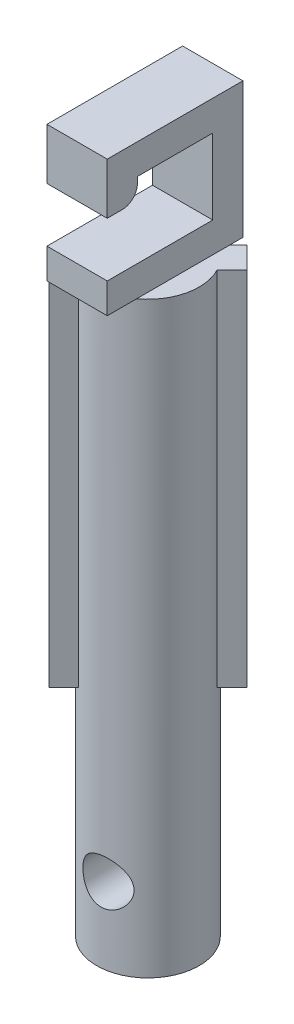
ISO-10303-21;
HEADER;
FILE_DESCRIPTION(('STEP AP214'),'2;1');
FILE_NAME('part.step','',(''),(''),'','','');
FILE_SCHEMA(('AUTOMOTIVE_DESIGN { 1 0 10303 214 1 1 1 1 }'));
ENDSEC;
DATA;
#1=APPLICATION_CONTEXT('core data for automotive mechanical design processes');
#2=APPLICATION_PROTOCOL_DEFINITION('international standard','automotive_design',2000,#1);
#3=PRODUCT_CONTEXT('',#1,'mechanical');
#4=PRODUCT('Part','Part','',(#3));
#5=PRODUCT_RELATED_PRODUCT_CATEGORY('part','',(#4));
#6=PRODUCT_DEFINITION_FORMATION('','',#4);
#7=PRODUCT_DEFINITION_CONTEXT('part definition',#1,'design');
#8=PRODUCT_DEFINITION('design','',#6,#7);
#9=PRODUCT_DEFINITION_SHAPE('','',#8);
#10=(LENGTH_UNIT() NAMED_UNIT(*) SI_UNIT(.MILLI.,.METRE.));
#11=(NAMED_UNIT(*) PLANE_ANGLE_UNIT() SI_UNIT($,.RADIAN.));
#12=(NAMED_UNIT(*) SI_UNIT($,.STERADIAN.) SOLID_ANGLE_UNIT());
#13=UNCERTAINTY_MEASURE_WITH_UNIT(LENGTH_MEASURE(1.E-05),#10,'distance_accuracy_value','');
#14=(GEOMETRIC_REPRESENTATION_CONTEXT(3) GLOBAL_UNCERTAINTY_ASSIGNED_CONTEXT((#13)) GLOBAL_UNIT_ASSIGNED_CONTEXT((#10,
#11,#12)) REPRESENTATION_CONTEXT('',''));
#15=CARTESIAN_POINT('',(0.,0.,0.));
#16=DIRECTION('',(0.,0.,1.));
#17=DIRECTION('',(1.,0.,0.));
#18=AXIS2_PLACEMENT_3D('',#15,#16,#17);
#19=CARTESIAN_POINT('',(0.,-6.,0.));
#20=DIRECTION('',(0.,1.,0.));
#21=DIRECTION('',(0.,0.,1.));
#22=AXIS2_PLACEMENT_3D('',#19,#20,#21);
#23=PLANE('',#22);
#24=CARTESIAN_POINT('',(0.,-6.,0.));
#25=DIRECTION('',(0.,-1.,0.));
#26=DIRECTION('',(0.,0.,-1.));
#27=AXIS2_PLACEMENT_3D('',#24,#25,#26);
#28=CIRCLE('',#27,1.7);
#29=CARTESIAN_POINT('',(0.795359138714328,-6.,-1.50246591990088));
#30=VERTEX_POINT('',#29);
#31=CARTESIAN_POINT('',(1.50246591990088,-6.,-0.795359138714331));
#32=VERTEX_POINT('',#31);
#33=EDGE_CURVE('E53',#30,#32,#28,.T.);
#34=ORIENTED_EDGE('',*,*,#33,.F.);
#35=DIRECTION('',(-0.707106781186548,0.,0.707106781186547));
#36=VECTOR('',#35,1.);
#37=CARTESIAN_POINT('',(1.29033388554492,-6.,-1.99744066673147));
#38=LINE('',#37,#36);
#39=CARTESIAN_POINT('',(1.29033388554492,-6.,-1.99744066673147));
#40=VERTEX_POINT('',#39);
#41=EDGE_CURVE('E190',#40,#30,#38,.T.);
#42=ORIENTED_EDGE('',*,*,#41,.F.);
#43=DIRECTION('',(-0.707106781186547,0.,-0.707106781186548));
#44=VECTOR('',#43,1.);
#45=CARTESIAN_POINT('',(1.99744066673147,-6.,-1.29033388554492));
#46=LINE('',#45,#44);
#47=CARTESIAN_POINT('',(1.99744066673147,-6.,-1.29033388554492));
#48=VERTEX_POINT('',#47);
#49=EDGE_CURVE('E214',#48,#40,#46,.T.);
#50=ORIENTED_EDGE('',*,*,#49,.F.);
#51=DIRECTION('',(0.707106781186547,0.,-0.707106781186548));
#52=VECTOR('',#51,1.);
#53=CARTESIAN_POINT('',(1.50246591990087,-6.,-0.795359138714324));
#54=LINE('',#53,#52);
#55=EDGE_CURVE('E192',#32,#48,#54,.T.);
#56=ORIENTED_EDGE('',*,*,#55,.F.);
#57=EDGE_LOOP('',(#34,#42,#50,#56));
#58=FACE_BOUND('',#57,.T.);
#59=ADVANCED_FACE('F38',(#58),#23,.F.);
#60=CARTESIAN_POINT('',(-0.795359138714333,-6.,1.50246591990088));
#61=VERTEX_POINT('',#60);
#62=CARTESIAN_POINT('',(-1.50246591990088,-6.,0.795359138714331));
#63=VERTEX_POINT('',#62);
#64=EDGE_CURVE('E12',#61,#63,#28,.T.);
#65=ORIENTED_EDGE('',*,*,#64,.F.);
#66=DIRECTION('',(0.707106781186547,0.,-0.707106781186548));
#67=VECTOR('',#66,1.);
#68=CARTESIAN_POINT('',(-0.795359138714333,-6.,1.50246591990088));
#69=LINE('',#68,#67);
#70=CARTESIAN_POINT('',(-1.29033388554492,-6.,1.99744066673146));
#71=VERTEX_POINT('',#70);
#72=EDGE_CURVE('E233',#71,#61,#69,.T.);
#73=ORIENTED_EDGE('',*,*,#72,.F.);
#74=DIRECTION('',(0.707106781186556,0.,0.707106781186539));
#75=VECTOR('',#74,1.);
#76=CARTESIAN_POINT('',(-1.29033388554492,-6.,1.99744066673146));
#77=LINE('',#76,#75);
#78=CARTESIAN_POINT('',(-1.99744066673147,-6.,1.29033388554492));
#79=VERTEX_POINT('',#78);
#80=EDGE_CURVE('E229',#79,#71,#77,.T.);
#81=ORIENTED_EDGE('',*,*,#80,.F.);
#82=DIRECTION('',(-0.707106781186547,0.,0.707106781186548));
#83=VECTOR('',#82,1.);
#84=CARTESIAN_POINT('',(-1.99744066673147,-6.,1.29033388554492));
#85=LINE('',#84,#83);
#86=EDGE_CURVE('E226',#63,#79,#85,.T.);
#87=ORIENTED_EDGE('',*,*,#86,.F.);
#88=EDGE_LOOP('',(#65,#73,#81,#87));
#89=FACE_BOUND('',#88,.T.);
#90=ADVANCED_FACE('F368',(#89),#23,.F.);
#91=CARTESIAN_POINT('',(-1.,10.5,2.35));
#92=DIRECTION('',(0.,0.,-1.));
#93=DIRECTION('',(-1.,0.,0.));
#94=AXIS2_PLACEMENT_3D('',#91,#92,#93);
#95=PLANE('',#94);
#96=DIRECTION('',(0.,-1.,0.));
#97=VECTOR('',#96,1.);
#98=CARTESIAN_POINT('',(-1.,10.5,2.35));
#99=LINE('',#98,#97);
#100=CARTESIAN_POINT('',(-1.,10.5,2.35));
#101=VERTEX_POINT('',#100);
#102=CARTESIAN_POINT('',(-1.,8.8,2.35));
#103=VERTEX_POINT('',#102);
#104=EDGE_CURVE('E440',#101,#103,#99,.T.);
#105=ORIENTED_EDGE('',*,*,#104,.T.);
#106=DIRECTION('',(1.,0.,0.));
#107=VECTOR('',#106,1.);
#108=CARTESIAN_POINT('',(-1.,8.8,2.35));
#109=LINE('',#108,#107);
#110=CARTESIAN_POINT('',(1.,8.8,2.35));
#111=VERTEX_POINT('',#110);
#112=EDGE_CURVE('E263',#103,#111,#109,.T.);
#113=ORIENTED_EDGE('',*,*,#112,.T.);
#114=DIRECTION('',(0.,-1.,0.));
#115=VECTOR('',#114,1.);
#116=CARTESIAN_POINT('',(1.,10.5,2.35));
#117=LINE('',#116,#115);
#118=CARTESIAN_POINT('',(1.,10.5,2.35));
#119=VERTEX_POINT('',#118);
#120=EDGE_CURVE('E433',#119,#111,#117,.T.);
#121=ORIENTED_EDGE('',*,*,#120,.F.);
#122=DIRECTION('',(1.,0.,0.));
#123=VECTOR('',#122,1.);
#124=CARTESIAN_POINT('',(-1.,10.5,2.35));
#125=LINE('',#124,#123);
#126=EDGE_CURVE('E429',#101,#119,#125,.T.);
#127=ORIENTED_EDGE('',*,*,#126,.F.);
#128=EDGE_LOOP('',(#105,#113,#121,#127));
#129=FACE_BOUND('',#128,.T.);
#130=ADVANCED_FACE('F331',(#129),#95,.F.);
#131=CARTESIAN_POINT('',(0.,6.,0.));
#132=DIRECTION('',(0.,1.,0.));
#133=DIRECTION('',(0.,0.,1.));
#134=AXIS2_PLACEMENT_3D('',#131,#132,#133);
#135=PLANE('',#134);
#136=DIRECTION('',(0.,0.,-1.));
#137=VECTOR('',#136,1.);
#138=CARTESIAN_POINT('',(1.,6.,-2.15));
#139=LINE('',#138,#137);
#140=CARTESIAN_POINT('',(1.,6.,1.37477270848675));
#141=VERTEX_POINT('',#140);
#142=CARTESIAN_POINT('',(1.,6.,-1.70710678118655));
#143=VERTEX_POINT('',#142);
#144=EDGE_CURVE('E264',#141,#143,#139,.T.);
#145=ORIENTED_EDGE('',*,*,#144,.F.);
#146=CARTESIAN_POINT('',(0.,6.,0.));
#147=DIRECTION('',(0.,1.,0.));
#148=DIRECTION('',(0.,0.,1.));
#149=AXIS2_PLACEMENT_3D('',#146,#147,#148);
#150=CIRCLE('',#149,1.7);
#151=CARTESIAN_POINT('',(1.50246591990088,6.,-0.795359138714331));
#152=VERTEX_POINT('',#151);
#153=EDGE_CURVE('E259',#141,#152,#150,.T.);
#154=ORIENTED_EDGE('',*,*,#153,.T.);
#155=DIRECTION('',(0.707106781186547,0.,-0.707106781186548));
#156=VECTOR('',#155,1.);
#157=CARTESIAN_POINT('',(1.50246591990087,6.,-0.795359138714324));
#158=LINE('',#157,#156);
#159=CARTESIAN_POINT('',(1.99744066673147,6.,-1.29033388554492));
#160=VERTEX_POINT('',#159);
#161=EDGE_CURVE('E221',#152,#160,#158,.T.);
#162=ORIENTED_EDGE('',*,*,#161,.T.);
#163=DIRECTION('',(-0.707106781186547,0.,-0.707106781186548));
#164=VECTOR('',#163,1.);
#165=CARTESIAN_POINT('',(1.99744066673147,6.,-1.29033388554492));
#166=LINE('',#165,#164);
#167=CARTESIAN_POINT('',(1.29033388554492,6.,-1.99744066673147));
#168=VERTEX_POINT('',#167);
#169=EDGE_CURVE('E450',#160,#168,#166,.T.);
#170=ORIENTED_EDGE('',*,*,#169,.T.);
#171=DIRECTION('',(-0.707106781186548,0.,0.707106781186547));
#172=VECTOR('',#171,1.);
#173=CARTESIAN_POINT('',(1.29033388554492,6.,-1.99744066673147));
#174=LINE('',#173,#172);
#175=EDGE_CURVE('E448',#168,#143,#174,.T.);
#176=ORIENTED_EDGE('',*,*,#175,.T.);
#177=EDGE_LOOP('',(#145,#154,#162,#170,#176));
#178=FACE_BOUND('',#177,.T.);
#179=ADVANCED_FACE('F366',(#178),#135,.T.);
#180=CARTESIAN_POINT('',(0.,6.,0.));
#181=DIRECTION('',(0.,-1.,0.));
#182=DIRECTION('',(0.,0.,-1.));
#183=AXIS2_PLACEMENT_3D('',#180,#181,#182);
#184=CYLINDRICAL_SURFACE('',#183,1.7);
#185=CARTESIAN_POINT('',(0.,-10.27715838526,-1.7));
#186=CARTESIAN_POINT('',(-0.0394264853913499,-10.2880720063862,-1.69999667269277));
#187=CARTESIAN_POINT('',(-0.0780153427794378,-10.3022371674687,-1.69861364502466));
#188=CARTESIAN_POINT('',(-0.152308740502231,-10.3366266919595,-1.69357604249851));
#189=CARTESIAN_POINT('',(-0.188004903280753,-10.3568679080192,-1.68991511893125));
#190=CARTESIAN_POINT('',(-0.255381027209626,-10.4026885421015,-1.68105045986878));
#191=CARTESIAN_POINT('',(-0.287074752281251,-10.4282488181224,-1.67585222926137));
#192=CARTESIAN_POINT('',(-0.345840338645468,-10.4840534231706,-1.66471935174611));
#193=CARTESIAN_POINT('',(-0.372913781461901,-10.5142961426082,-1.65878495803308));
#194=CARTESIAN_POINT('',(-0.422867780492932,-10.580105033303,-1.64677594592019));
#195=CARTESIAN_POINT('',(-0.445527308756437,-10.6158402150859,-1.64070575038292));
#196=CARTESIAN_POINT('',(-0.484575568276794,-10.6907433613267,-1.62960136660368));
#197=CARTESIAN_POINT('',(-0.500964233105861,-10.7299113621433,-1.6245671893366));
#198=CARTESIAN_POINT('',(-0.526903770035895,-10.8105312608712,-1.61634122643404));
#199=CARTESIAN_POINT('',(-0.536472466276856,-10.8519768981359,-1.61314464247375));
#200=CARTESIAN_POINT('',(-0.548466615946591,-10.9359949828413,-1.60910723881688));
#201=CARTESIAN_POINT('',(-0.550894967480492,-10.9785669660424,-1.6082654633633));
#202=CARTESIAN_POINT('',(-0.548574926941224,-11.0613628226251,-1.60905735271729));
#203=CARTESIAN_POINT('',(-0.544177253120613,-11.1015982316501,-1.61057005625134));
#204=CARTESIAN_POINT('',(-0.529015769753998,-11.1807177570162,-1.61561294270764));
#205=CARTESIAN_POINT('',(-0.518251300250154,-11.2196017328306,-1.61914333477455));
#206=CARTESIAN_POINT('',(-0.490675912874903,-11.2951060739547,-1.62771143105451));
#207=CARTESIAN_POINT('',(-0.473847329003936,-11.3317194554474,-1.63275353189828));
#208=CARTESIAN_POINT('',(-0.434620470465107,-11.4017053998239,-1.64362957401005));
#209=CARTESIAN_POINT('',(-0.412220473669044,-11.4350769562137,-1.64946375985845));
#210=CARTESIAN_POINT('',(-0.361119547994371,-11.4994160942537,-1.66141931639262));
#211=CARTESIAN_POINT('',(-0.332157140358752,-11.5301765863541,-1.66754028074076));
#212=CARTESIAN_POINT('',(-0.269373918348366,-11.5864860925356,-1.67882496909745));
#213=CARTESIAN_POINT('',(-0.235552957416432,-11.6120349493525,-1.68398866421943));
#214=CARTESIAN_POINT('',(-0.163892387759623,-11.6571723385187,-1.69246560239895));
#215=CARTESIAN_POINT('',(-0.126050691128686,-11.6767577535372,-1.69577787839881));
#216=CARTESIAN_POINT('',(-0.0474815586580849,-11.7092656087483,-1.69979078734408));
#217=CARTESIAN_POINT('',(-0.00675569618852263,-11.7221916503962,-1.70049283320776));
#218=CARTESIAN_POINT('',(0.0736915119306994,-11.7403660135858,-1.69884915281052));
#219=CARTESIAN_POINT('',(0.113321757073787,-11.746035860147,-1.69668735098685));
#220=CARTESIAN_POINT('',(0.192717143619638,-11.7510183512937,-1.68951113574318));
#221=CARTESIAN_POINT('',(0.232482267007519,-11.7503318138395,-1.68449708943723));
#222=CARTESIAN_POINT('',(0.309925040012969,-11.7428932825665,-1.67195867927891));
#223=CARTESIAN_POINT('',(0.347630080597687,-11.736303032282,-1.66450459966964));
#224=CARTESIAN_POINT('',(0.421145457794468,-11.7176586600817,-1.64744107806811));
#225=CARTESIAN_POINT('',(0.456955372180915,-11.7056033262452,-1.63783115824203));
#226=CARTESIAN_POINT('',(0.528111150889162,-11.6755927566442,-1.6163429269406));
#227=CARTESIAN_POINT('',(0.563290247270962,-11.6573177593373,-1.60436084038069));
#228=CARTESIAN_POINT('',(0.630087357445425,-11.6156912658995,-1.57932411498767));
#229=CARTESIAN_POINT('',(0.661703385161235,-11.5923369595702,-1.56626888492013));
#230=CARTESIAN_POINT('',(0.723864038021602,-11.538447072479,-1.53860042777845));
#231=CARTESIAN_POINT('',(0.75397709138004,-11.5074241415561,-1.52396314179396));
#232=CARTESIAN_POINT('',(0.808642424802498,-11.4403711223812,-1.49567595288468));
#233=CARTESIAN_POINT('',(0.833191035127331,-11.40433775488,-1.48202670558419));
#234=CARTESIAN_POINT('',(0.876275276586807,-11.3273031238386,-1.45697399298732));
#235=CARTESIAN_POINT('',(0.894714381740906,-11.2862349848523,-1.44560760337277));
#236=CARTESIAN_POINT('',(0.924071484419905,-11.2006394393135,-1.42702497737228));
#237=CARTESIAN_POINT('',(0.935005172970389,-11.1561194676079,-1.41980008790636));
#238=CARTESIAN_POINT('',(0.947579872739925,-11.071883336904,-1.41143199922745));
#239=CARTESIAN_POINT('',(0.9503380669055,-11.0324061618015,-1.40955910207369));
#240=CARTESIAN_POINT('',(0.94959611100042,-10.9535416751533,-1.41005968759455));
#241=CARTESIAN_POINT('',(0.946097966643248,-10.9141543388594,-1.41243180936283));
#242=CARTESIAN_POINT('',(0.933786106211015,-10.8409790093227,-1.4205943886504));
#243=CARTESIAN_POINT('',(0.925577272288964,-10.8070410121549,-1.42599447284198));
#244=CARTESIAN_POINT('',(0.904738643716123,-10.7410780513305,-1.43930544989543));
#245=CARTESIAN_POINT('',(0.892107546631795,-10.709053654519,-1.44721708238793));
#246=CARTESIAN_POINT('',(0.861504429797852,-10.6446147832866,-1.46565902891068));
#247=CARTESIAN_POINT('',(0.843149263887894,-10.6124330988192,-1.47636279236414));
#248=CARTESIAN_POINT('',(0.802171295504089,-10.5513990314522,-1.4990229401643));
#249=CARTESIAN_POINT('',(0.779545812275459,-10.522548758332,-1.51098010924711));
#250=CARTESIAN_POINT('',(0.726567191437288,-10.4642646850688,-1.53723933729124));
#251=CARTESIAN_POINT('',(0.69555806043603,-10.4354566657034,-1.55161376594344));
#252=CARTESIAN_POINT('',(0.628968628007917,-10.3833361540191,-1.57978034094578));
#253=CARTESIAN_POINT('',(0.59338656940549,-10.3600257840188,-1.59357226074241));
#254=CARTESIAN_POINT('',(0.516610965031167,-10.3186464417802,-1.62013408705235));
#255=CARTESIAN_POINT('',(0.475236347264699,-10.3008623989423,-1.6328294993973));
#256=CARTESIAN_POINT('',(0.389257492355608,-10.2728678245188,-1.65542998006842));
#257=CARTESIAN_POINT('',(0.344654110921189,-10.2626552942887,-1.66533578433614));
#258=CARTESIAN_POINT('',(0.2576473107431,-10.2510441036712,-1.68089318098566));
#259=CARTESIAN_POINT('',(0.215387579168656,-10.2489591366437,-1.68683876019696));
#260=CARTESIAN_POINT('',(0.130872140312205,-10.2520038284326,-1.69548355791858));
#261=CARTESIAN_POINT('',(0.0886167782195769,-10.2571125389309,-1.69819216024295));
#262=CARTESIAN_POINT('',(0.0312998688585426,-10.2690385563064,-1.69978705752143));
#263=CARTESIAN_POINT('',(0.015584496340526,-10.2728444504312,-1.7000013152176));
#264=CARTESIAN_POINT('',(0.,-10.27715838526,-1.7));
#265=B_SPLINE_CURVE_WITH_KNOTS('',3,(#185,#186,#187,#188,#189,#190,#191,#192,#193,#194,#195,
#196,#197,#198,#199,#200,#201,#202,#203,#204,#205,#206,#207,#208,#209,#210,#211,#212,#213,#214,
#215,#216,#217,#218,#219,#220,#221,#222,#223,#224,#225,#226,#227,#228,#229,#230,#231,#232,#233,
#234,#235,#236,#237,#238,#239,#240,#241,#242,#243,#244,#245,#246,#247,#248,#249,#250,#251,#252,
#253,#254,#255,#256,#257,#258,#259,#260,#261,#262,#263,#264),.UNSPECIFIED.,.T.,.F.,(4,2,2,2,2,2,
2,2,2,2,2,2,2,2,2,2,2,2,2,2,2,2,2,2,2,2,2,2,2,2,2,2,2,2,2,2,2,2,2,4),(0.,0.122680815017223,
0.245705094048257,0.368294066611866,0.490840992402387,0.618481147663853,0.74612265499082,
0.873429332824028,1.00068433260624,1.12161416546202,1.24255653564197,1.36385412234969,
1.4851892489349,1.61266404269239,1.74014268250609,1.8676878465707,1.99516396034337,
2.11483723383862,2.23449510760098,2.35097171681189,2.46747416817425,2.59120792754841,
2.71501031928969,2.85133077357924,2.98774087104691,3.12621344010656,3.26439562573062,
3.38254984584199,3.50066619379649,3.60622075197209,3.7118064239916,3.8270602426344,
3.94238665567589,4.07590433894674,4.20947348147054,4.34908711305403,4.48866387783445,
4.61616092190277,4.74328745561945,4.79178071322816),.UNSPECIFIED.);
#266=CARTESIAN_POINT('',(0.,-10.27715838526,-1.7));
#267=VERTEX_POINT('',#266);
#268=EDGE_CURVE('E42',#267,#267,#265,.T.);
#269=ORIENTED_EDGE('',*,*,#268,.T.);
#270=EDGE_LOOP('',(#269));
#271=FACE_BOUND('',#270,.T.);
#272=CARTESIAN_POINT('',(0.949999999999962,-11.,1.40978721798719));
#273=CARTESIAN_POINT('',(0.949997032045403,-11.0380267286663,1.40979090827347));
#274=CARTESIAN_POINT('',(0.947086150404072,-11.076104782932,1.41176431782103));
#275=CARTESIAN_POINT('',(0.935613240828145,-11.1510571467728,1.41939145108898));
#276=CARTESIAN_POINT('',(0.927038755989557,-11.1879286144536,1.42505328700106));
#277=CARTESIAN_POINT('',(0.904766557789956,-11.2592107280324,1.43929468818161));
#278=CARTESIAN_POINT('',(0.891100872172196,-11.2936351884403,1.44785598352606));
#279=CARTESIAN_POINT('',(0.859172828211612,-11.3596342310459,1.46702685793239));
#280=CARTESIAN_POINT('',(0.840910298896147,-11.3912087071833,1.47763651317649));
#281=CARTESIAN_POINT('',(0.798259828109986,-11.4540545925271,1.5011428130915));
#282=CARTESIAN_POINT('',(0.77344613715752,-11.4849908776028,1.51416175604276));
#283=CARTESIAN_POINT('',(0.719364029711288,-11.5425138381544,1.54059155758166));
#284=CARTESIAN_POINT('',(0.690092744585734,-11.5690976896473,1.55400266401847));
#285=CARTESIAN_POINT('',(0.623881663916443,-11.6203022467732,1.58183641336953));
#286=CARTESIAN_POINT('',(0.586444633168204,-11.6443219636552,1.59619189461794));
#287=CARTESIAN_POINT('',(0.507380509828829,-11.6855677580672,1.62305437706239));
#288=CARTESIAN_POINT('',(0.465754285004665,-11.702795238948,1.63556175976172));
#289=CARTESIAN_POINT('',(0.380990875007236,-11.7291341246324,1.65731320027794));
#290=CARTESIAN_POINT('',(0.337968119302007,-11.7385245221363,1.66666165767673));
#291=CARTESIAN_POINT('',(0.25037372711552,-11.7496042882272,1.68204762817585));
#292=CARTESIAN_POINT('',(0.205803444009603,-11.7513002231103,1.68808796048946));
#293=CARTESIAN_POINT('',(0.121310591407558,-11.7469347507103,1.69614259435246));
#294=CARTESIAN_POINT('',(0.0813794530198095,-11.741649918202,1.69850582627429));
#295=CARTESIAN_POINT('',(0.00282027527619603,-11.7247300423192,1.70045142651476));
#296=CARTESIAN_POINT('',(-0.0358079294280826,-11.7130958079575,1.70003414903773));
#297=CARTESIAN_POINT('',(-0.109390864103437,-11.6843160395951,1.69686422999453));
#298=CARTESIAN_POINT('',(-0.144424033080683,-11.6673611178262,1.6941876292815));
#299=CARTESIAN_POINT('',(-0.211327341497279,-11.6283394109002,1.68714952637835));
#300=CARTESIAN_POINT('',(-0.24319682198416,-11.6062715639695,1.68278767409535));
#301=CARTESIAN_POINT('',(-0.304589125033832,-11.5563571946248,1.6727946920121));
#302=CARTESIAN_POINT('',(-0.333911137419226,-11.5282744728663,1.66711043462606));
#303=CARTESIAN_POINT('',(-0.387634719976913,-11.4677852093194,1.65544454262405));
#304=CARTESIAN_POINT('',(-0.412034470628569,-11.4353770759653,1.64946279905667));
#305=CARTESIAN_POINT('',(-0.456421924254979,-11.3652616667623,1.63775257216903));
#306=CARTESIAN_POINT('',(-0.476127384907709,-11.3273702620461,1.63205178584218));
#307=CARTESIAN_POINT('',(-0.50887330096443,-11.2486272212357,1.6221414551495));
#308=CARTESIAN_POINT('',(-0.521915530550489,-11.2077763764466,1.61793151391621));
#309=CARTESIAN_POINT('',(-0.540654073679456,-11.1252267925328,1.61176596842874));
#310=CARTESIAN_POINT('',(-0.546509583163697,-11.0835680168934,1.60976161540305));
#311=CARTESIAN_POINT('',(-0.551170899603043,-10.9998176658142,1.60817212494293));
#312=CARTESIAN_POINT('',(-0.549978688954341,-10.9577262154029,1.60858630721787));
#313=CARTESIAN_POINT('',(-0.540809845155919,-10.87628313383,1.61169017106248));
#314=CARTESIAN_POINT('',(-0.533136668373352,-10.8368928144008,1.61427804499248));
#315=CARTESIAN_POINT('',(-0.511677041922494,-10.7599777488201,1.62120712936821));
#316=CARTESIAN_POINT('',(-0.497889471347803,-10.7224533461367,1.62554866128601));
#317=CARTESIAN_POINT('',(-0.464250873872699,-10.6493950291251,1.63547664307831));
#318=CARTESIAN_POINT('',(-0.444273213123989,-10.6139230079661,1.6410883626558));
#319=CARTESIAN_POINT('',(-0.3988894541501,-10.5467042600348,1.6527053035917));
#320=CARTESIAN_POINT('',(-0.373481651386535,-10.5149587078716,1.65871064809887));
#321=CARTESIAN_POINT('',(-0.316522072666186,-10.4545582057329,1.67053798608962));
#322=CARTESIAN_POINT('',(-0.284739169348035,-10.4261162036221,1.67633839587059));
#323=CARTESIAN_POINT('',(-0.216661278661381,-10.3749354102235,1.68648743840737));
#324=CARTESIAN_POINT('',(-0.18036703014015,-10.3521956868788,1.69083630846085));
#325=CARTESIAN_POINT('',(-0.105040904925962,-10.3135566788212,1.69716354126889));
#326=CARTESIAN_POINT('',(-0.0660798920498091,-10.2975274359157,1.69918840678073));
#327=CARTESIAN_POINT('',(0.0140114116090639,-10.2722159119494,1.70041287543886));
#328=CARTESIAN_POINT('',(0.0551405835332638,-10.262930186816,1.69961392200059));
#329=CARTESIAN_POINT('',(0.135589842820965,-10.2517372082405,1.6950331062899));
#330=CARTESIAN_POINT('',(0.17486235933997,-10.249405114108,1.69144077619227));
#331=CARTESIAN_POINT('',(0.252943130251941,-10.2508526230858,1.68153750169154));
#332=CARTESIAN_POINT('',(0.291751381930058,-10.2546322619176,1.67522654139889));
#333=CARTESIAN_POINT('',(0.367673403736189,-10.2679717847695,1.66021330519692));
#334=CARTESIAN_POINT('',(0.404794208397336,-10.2775047336671,1.65152227493998));
#335=CARTESIAN_POINT('',(0.476710758877877,-10.3018781584561,1.63221781733368));
#336=CARTESIAN_POINT('',(0.511505937603963,-10.3167199233145,1.62160392342701));
#337=CARTESIAN_POINT('',(0.580823727945345,-10.3526077809707,1.59815132272965));
#338=CARTESIAN_POINT('',(0.615100332318949,-10.3740562222129,1.58520242434237));
#339=CARTESIAN_POINT('',(0.679638893594583,-10.4220161551028,1.55862491521141));
#340=CARTESIAN_POINT('',(0.709897358489821,-10.4485320024563,1.54499572722335));
#341=CARTESIAN_POINT('',(0.768489626207751,-10.5088291702218,1.51676523535233));
#342=CARTESIAN_POINT('',(0.796378812274951,-10.5430580448898,1.50219221621915));
#343=CARTESIAN_POINT('',(0.845982343857728,-10.6163833535271,1.47482807934991));
#344=CARTESIAN_POINT('',(0.867699976216717,-10.6554771805091,1.46203601497242));
#345=CARTESIAN_POINT('',(0.900638842335825,-10.7299332290644,1.44192566755183));
#346=CARTESIAN_POINT('',(0.91306774283908,-10.7646060705365,1.43402989059111));
#347=CARTESIAN_POINT('',(0.932749727109323,-10.8358793687877,1.42130859200741));
#348=CARTESIAN_POINT('',(0.940017408660757,-10.8724740720182,1.41647441530706));
#349=CARTESIAN_POINT('',(0.946342536555192,-10.9244893534554,1.41224620001753));
#350=CARTESIAN_POINT('',(0.947711873942688,-10.9395400429815,1.4113268824657));
#351=CARTESIAN_POINT('',(0.949541299128,-10.9697244303908,1.41009658811585));
#352=CARTESIAN_POINT('',(0.95000118180906,-10.9848581462281,1.40978574855301));
#353=CARTESIAN_POINT('',(0.949999999999962,-11.,1.40978721798719));
#354=B_SPLINE_CURVE_WITH_KNOTS('',3,(#272,#273,#274,#275,#276,#277,#278,#279,#280,#281,#282,
#283,#284,#285,#286,#287,#288,#289,#290,#291,#292,#293,#294,#295,#296,#297,#298,#299,#300,#301,
#302,#303,#304,#305,#306,#307,#308,#309,#310,#311,#312,#313,#314,#315,#316,#317,#318,#319,#320,
#321,#322,#323,#324,#325,#326,#327,#328,#329,#330,#331,#332,#333,#334,#335,#336,#337,#338,#339,
#340,#341,#342,#343,#344,#345,#346,#347,#348,#349,#350,#351,#352,#353),.UNSPECIFIED.,.T.,.F.,(4,
2,2,2,2,2,2,2,2,2,2,2,2,2,2,2,2,2,2,2,2,2,2,2,2,2,2,2,2,2,2,2,2,2,2,2,2,2,2,2,4),(0.,
0.114015155531712,0.228281922342415,0.341841674649579,0.455405651264058,0.580137012167039,
0.704948984338129,0.844476400519712,0.983974973673933,1.11826552234461,1.25244144863952,
1.37287764956703,1.49329850862627,1.60982094243375,1.72636759554973,1.84882137619885,
1.97132033944225,2.09995569885732,2.22855678936521,2.35425454645893,2.47991694872988,
2.60000217022741,2.72010941516285,2.84285706048085,2.96564329340629,3.09415112996909,
3.22263794777446,3.3485063156955,3.47431035439838,3.59225247886128,3.71019529266916,
3.827590174207,3.94501357829523,4.0718612250318,4.1988183985137,4.3376483074672,
4.47640413928105,4.58895795784827,4.70119215197904,4.74658158294647,4.79198124979639),.UNSPECIFIED.);
#355=CARTESIAN_POINT('',(0.949999999999962,-11.,1.40978721798719));
#356=VERTEX_POINT('',#355);
#357=EDGE_CURVE('E280',#356,#356,#354,.T.);
#358=ORIENTED_EDGE('',*,*,#357,.T.);
#359=EDGE_LOOP('',(#358));
#360=FACE_BOUND('',#359,.T.);
#361=DIRECTION('',(0.,1.,0.));
#362=VECTOR('',#361,1.);
#363=CARTESIAN_POINT('',(-0.795359138714333,-6.,1.50246591990088));
#364=LINE('',#363,#362);
#365=CARTESIAN_POINT('',(-0.795359138714332,6.,1.50246591990088));
#366=VERTEX_POINT('',#365);
#367=EDGE_CURVE('E245',#61,#366,#364,.T.);
#368=ORIENTED_EDGE('',*,*,#367,.F.);
#369=ORIENTED_EDGE('',*,*,#64,.T.);
#370=DIRECTION('',(0.,1.,0.));
#371=VECTOR('',#370,1.);
#372=CARTESIAN_POINT('',(-1.50246591990087,-6.,0.795359138714324));
#373=LINE('',#372,#371);
#374=CARTESIAN_POINT('',(-1.50246591990088,6.,0.795359138714331));
#375=VERTEX_POINT('',#374);
#376=EDGE_CURVE('E236',#63,#375,#373,.T.);
#377=ORIENTED_EDGE('',*,*,#376,.T.);
#378=CARTESIAN_POINT('',(-1.,6.,-1.37477270848675));
#379=VERTEX_POINT('',#378);
#380=EDGE_CURVE('E248',#379,#375,#150,.T.);
#381=ORIENTED_EDGE('',*,*,#380,.F.);
#382=CARTESIAN_POINT('',(0.79535913871433,6.,-1.50246591990088));
#383=VERTEX_POINT('',#382);
#384=EDGE_CURVE('E205',#383,#379,#150,.T.);
#385=ORIENTED_EDGE('',*,*,#384,.F.);
#386=DIRECTION('',(0.,1.,0.));
#387=VECTOR('',#386,1.);
#388=CARTESIAN_POINT('',(0.795359138714324,-6.,-1.50246591990087));
#389=LINE('',#388,#387);
#390=EDGE_CURVE('E199',#30,#383,#389,.T.);
#391=ORIENTED_EDGE('',*,*,#390,.F.);
#392=ORIENTED_EDGE('',*,*,#33,.T.);
#393=DIRECTION('',(0.,1.,0.));
#394=VECTOR('',#393,1.);
#395=CARTESIAN_POINT('',(1.50246591990087,-6.,-0.795359138714324));
#396=LINE('',#395,#394);
#397=EDGE_CURVE('E215',#32,#152,#396,.T.);
#398=ORIENTED_EDGE('',*,*,#397,.T.);
#399=ORIENTED_EDGE('',*,*,#153,.F.);
#400=EDGE_CURVE('E255',#366,#141,#150,.T.);
#401=ORIENTED_EDGE('',*,*,#400,.F.);
#402=EDGE_LOOP('',(#368,#369,#377,#381,#385,#391,#392,#398,#399,#401));
#403=FACE_BOUND('',#402,.T.);
#404=CARTESIAN_POINT('',(0.,-13.5,0.));
#405=DIRECTION('',(0.,-1.,0.));
#406=DIRECTION('',(0.,0.,-1.));
#407=AXIS2_PLACEMENT_3D('',#404,#405,#406);
#408=CIRCLE('',#407,1.7);
#409=CARTESIAN_POINT('',(0.,-13.5,-1.7));
#410=VERTEX_POINT('',#409);
#411=EDGE_CURVE('E197',#410,#410,#408,.T.);
#412=ORIENTED_EDGE('',*,*,#411,.F.);
#413=EDGE_LOOP('',(#412));
#414=FACE_BOUND('',#413,.T.);
#415=ADVANCED_FACE('F201',(#271,#360,#403,#414),#184,.T.);
#416=DIRECTION('',(0.,0.,1.));
#417=VECTOR('',#416,1.);
#418=CARTESIAN_POINT('',(-1.,6.,-2.15));
#419=LINE('',#418,#417);
#420=CARTESIAN_POINT('',(-1.,6.,1.70710678118655));
#421=VERTEX_POINT('',#420);
#422=EDGE_CURVE('E258',#379,#421,#419,.T.);
#423=ORIENTED_EDGE('',*,*,#422,.F.);
#424=ORIENTED_EDGE('',*,*,#380,.T.);
#425=DIRECTION('',(-0.707106781186547,0.,0.707106781186548));
#426=VECTOR('',#425,1.);
#427=CARTESIAN_POINT('',(-1.99744066673147,6.,1.29033388554492));
#428=LINE('',#427,#426);
#429=CARTESIAN_POINT('',(-1.99744066673147,6.,1.29033388554492));
#430=VERTEX_POINT('',#429);
#431=EDGE_CURVE('E237',#375,#430,#428,.T.);
#432=ORIENTED_EDGE('',*,*,#431,.T.);
#433=DIRECTION('',(0.707106781186556,0.,0.707106781186539));
#434=VECTOR('',#433,1.);
#435=CARTESIAN_POINT('',(-1.29033388554492,6.,1.99744066673146));
#436=LINE('',#435,#434);
#437=CARTESIAN_POINT('',(-1.29033388554492,6.,1.99744066673146));
#438=VERTEX_POINT('',#437);
#439=EDGE_CURVE('E240',#430,#438,#436,.T.);
#440=ORIENTED_EDGE('',*,*,#439,.T.);
#441=DIRECTION('',(0.707106781186547,0.,-0.707106781186548));
#442=VECTOR('',#441,1.);
#443=CARTESIAN_POINT('',(-0.795359138714333,6.,1.50246591990088));
#444=LINE('',#443,#442);
#445=EDGE_CURVE('E230',#438,#421,#444,.T.);
#446=ORIENTED_EDGE('',*,*,#445,.T.);
#447=EDGE_LOOP('',(#423,#424,#432,#440,#446));
#448=FACE_BOUND('',#447,.T.);
#449=ADVANCED_FACE('F356',(#448),#135,.T.);
#450=CARTESIAN_POINT('',(-0.795359138714333,-6.,1.50246591990088));
#451=DIRECTION('',(0.707106781186548,0.,0.707106781186547));
#452=DIRECTION('',(0.707106781186547,0.,-0.707106781186548));
#453=AXIS2_PLACEMENT_3D('',#450,#451,#452);
#454=PLANE('',#453);
#455=ORIENTED_EDGE('',*,*,#445,.F.);
#456=DIRECTION('',(0.,1.,0.));
#457=VECTOR('',#456,1.);
#458=CARTESIAN_POINT('',(-1.29033388554492,-6.,1.99744066673146));
#459=LINE('',#458,#457);
#460=EDGE_CURVE('E249',#71,#438,#459,.T.);
#461=ORIENTED_EDGE('',*,*,#460,.F.);
#462=ORIENTED_EDGE('',*,*,#72,.T.);
#463=ORIENTED_EDGE('',*,*,#367,.T.);
#464=EDGE_CURVE('E243',#421,#366,#444,.T.);
#465=ORIENTED_EDGE('',*,*,#464,.F.);
#466=EDGE_LOOP('',(#455,#461,#462,#463,#465));
#467=FACE_BOUND('',#466,.T.);
#468=ADVANCED_FACE('F352',(#467),#454,.T.);
#469=CARTESIAN_POINT('',(-1.29033388554492,-6.,1.99744066673146));
#470=DIRECTION('',(-0.707106781186539,0.,0.707106781186556));
#471=DIRECTION('',(0.707106781186556,0.,0.707106781186539));
#472=AXIS2_PLACEMENT_3D('',#469,#470,#471);
#473=PLANE('',#472);
#474=ORIENTED_EDGE('',*,*,#439,.F.);
#475=DIRECTION('',(0.,1.,0.));
#476=VECTOR('',#475,1.);
#477=CARTESIAN_POINT('',(-1.99744066673147,-6.,1.29033388554492));
#478=LINE('',#477,#476);
#479=EDGE_CURVE('E251',#79,#430,#478,.T.);
#480=ORIENTED_EDGE('',*,*,#479,.F.);
#481=ORIENTED_EDGE('',*,*,#80,.T.);
#482=ORIENTED_EDGE('',*,*,#460,.T.);
#483=EDGE_LOOP('',(#474,#480,#481,#482));
#484=FACE_BOUND('',#483,.T.);
#485=ADVANCED_FACE('F355',(#484),#473,.T.);
#486=CARTESIAN_POINT('',(-1.99744066673147,-6.,1.29033388554492));
#487=DIRECTION('',(-0.707106781186548,0.,-0.707106781186547));
#488=DIRECTION('',(-0.707106781186547,0.,0.707106781186548));
#489=AXIS2_PLACEMENT_3D('',#486,#487,#488);
#490=PLANE('',#489);
#491=ORIENTED_EDGE('',*,*,#431,.F.);
#492=ORIENTED_EDGE('',*,*,#376,.F.);
#493=ORIENTED_EDGE('',*,*,#86,.T.);
#494=ORIENTED_EDGE('',*,*,#479,.T.);
#495=EDGE_LOOP('',(#491,#492,#493,#494));
#496=FACE_BOUND('',#495,.T.);
#497=ADVANCED_FACE('F351',(#496),#490,.T.);
#498=CARTESIAN_POINT('',(1.29033388554492,-6.,-1.99744066673147));
#499=DIRECTION('',(-0.707106781186547,0.,-0.707106781186548));
#500=DIRECTION('',(-0.707106781186548,0.,0.707106781186547));
#501=AXIS2_PLACEMENT_3D('',#498,#499,#500);
#502=PLANE('',#501);
#503=ORIENTED_EDGE('',*,*,#175,.F.);
#504=DIRECTION('',(0.,1.,0.));
#505=VECTOR('',#504,1.);
#506=CARTESIAN_POINT('',(1.29033388554492,-6.,-1.99744066673147));
#507=LINE('',#506,#505);
#508=EDGE_CURVE('E208',#40,#168,#507,.T.);
#509=ORIENTED_EDGE('',*,*,#508,.F.);
#510=ORIENTED_EDGE('',*,*,#41,.T.);
#511=ORIENTED_EDGE('',*,*,#390,.T.);
#512=EDGE_CURVE('E225',#143,#383,#174,.T.);
#513=ORIENTED_EDGE('',*,*,#512,.F.);
#514=EDGE_LOOP('',(#503,#509,#510,#511,#513));
#515=FACE_BOUND('',#514,.T.);
#516=ADVANCED_FACE('F212',(#515),#502,.T.);
#517=CARTESIAN_POINT('',(1.99744066673147,-6.,-1.29033388554492));
#518=DIRECTION('',(0.707106781186548,0.,-0.707106781186547));
#519=DIRECTION('',(-0.707106781186547,0.,-0.707106781186548));
#520=AXIS2_PLACEMENT_3D('',#517,#518,#519);
#521=PLANE('',#520);
#522=ORIENTED_EDGE('',*,*,#169,.F.);
#523=DIRECTION('',(0.,1.,0.));
#524=VECTOR('',#523,1.);
#525=CARTESIAN_POINT('',(1.99744066673147,-6.,-1.29033388554492));
#526=LINE('',#525,#524);
#527=EDGE_CURVE('E218',#48,#160,#526,.T.);
#528=ORIENTED_EDGE('',*,*,#527,.F.);
#529=ORIENTED_EDGE('',*,*,#49,.T.);
#530=ORIENTED_EDGE('',*,*,#508,.T.);
#531=EDGE_LOOP('',(#522,#528,#529,#530));
#532=FACE_BOUND('',#531,.T.);
#533=ADVANCED_FACE('F344',(#532),#521,.T.);
#534=CARTESIAN_POINT('',(1.50246591990087,-6.,-0.795359138714324));
#535=DIRECTION('',(0.707106781186548,0.,0.707106781186547));
#536=DIRECTION('',(0.707106781186547,0.,-0.707106781186548));
#537=AXIS2_PLACEMENT_3D('',#534,#535,#536);
#538=PLANE('',#537);
#539=ORIENTED_EDGE('',*,*,#161,.F.);
#540=ORIENTED_EDGE('',*,*,#397,.F.);
#541=ORIENTED_EDGE('',*,*,#55,.T.);
#542=ORIENTED_EDGE('',*,*,#527,.T.);
#543=EDGE_LOOP('',(#539,#540,#541,#542));
#544=FACE_BOUND('',#543,.T.);
#545=ADVANCED_FACE('F325',(#544),#538,.T.);
#546=CARTESIAN_POINT('',(0.,6.,0.));
#547=DIRECTION('',(0.,1.,0.));
#548=DIRECTION('',(0.,0.,1.));
#549=AXIS2_PLACEMENT_3D('',#546,#547,#548);
#550=PLANE('',#549);
#551=CARTESIAN_POINT('',(1.,6.,-2.15));
#552=VERTEX_POINT('',#551);
#553=EDGE_CURVE('E409',#143,#552,#139,.T.);
#554=ORIENTED_EDGE('',*,*,#553,.F.);
#555=ORIENTED_EDGE('',*,*,#512,.T.);
#556=ORIENTED_EDGE('',*,*,#384,.T.);
#557=CARTESIAN_POINT('',(-1.,6.,-2.15));
#558=VERTEX_POINT('',#557);
#559=EDGE_CURVE('E391',#558,#379,#419,.T.);
#560=ORIENTED_EDGE('',*,*,#559,.F.);
#561=DIRECTION('',(-1.,0.,0.));
#562=VECTOR('',#561,1.);
#563=CARTESIAN_POINT('',(-1.,6.,-2.15));
#564=LINE('',#563,#562);
#565=EDGE_CURVE('E404',#552,#558,#564,.T.);
#566=ORIENTED_EDGE('',*,*,#565,.F.);
#567=EDGE_LOOP('',(#554,#555,#556,#560,#566));
#568=FACE_BOUND('',#567,.T.);
#569=ADVANCED_FACE('F321',(#568),#550,.F.);
#570=ORIENTED_EDGE('',*,*,#464,.T.);
#571=ORIENTED_EDGE('',*,*,#400,.T.);
#572=CARTESIAN_POINT('',(1.,6.,2.35));
#573=VERTEX_POINT('',#572);
#574=EDGE_CURVE('E408',#573,#141,#139,.T.);
#575=ORIENTED_EDGE('',*,*,#574,.F.);
#576=DIRECTION('',(1.,0.,0.));
#577=VECTOR('',#576,1.);
#578=CARTESIAN_POINT('',(-1.,6.,2.35));
#579=LINE('',#578,#577);
#580=CARTESIAN_POINT('',(-1.,6.,2.35));
#581=VERTEX_POINT('',#580);
#582=EDGE_CURVE('E398',#581,#573,#579,.T.);
#583=ORIENTED_EDGE('',*,*,#582,.F.);
#584=EDGE_CURVE('E399',#421,#581,#419,.T.);
#585=ORIENTED_EDGE('',*,*,#584,.F.);
#586=EDGE_LOOP('',(#570,#571,#575,#583,#585));
#587=FACE_BOUND('',#586,.T.);
#588=ADVANCED_FACE('F324',(#587),#550,.F.);
#589=CARTESIAN_POINT('',(1.,10.5,-2.15));
#590=DIRECTION('',(-1.,0.,0.));
#591=DIRECTION('',(0.,0.,1.));
#592=AXIS2_PLACEMENT_3D('',#589,#590,#591);
#593=PLANE('',#592);
#594=DIRECTION('',(0.,0.,1.));
#595=VECTOR('',#594,1.);
#596=CARTESIAN_POINT('',(1.,8.8,0.));
#597=LINE('',#596,#595);
#598=CARTESIAN_POINT('',(1.,8.8,1.85));
#599=VERTEX_POINT('',#598);
#600=EDGE_CURVE('E460',#599,#111,#597,.T.);
#601=ORIENTED_EDGE('',*,*,#600,.F.);
#602=CARTESIAN_POINT('',(1.,9.3,1.85));
#603=DIRECTION('',(-1.,0.,0.));
#604=DIRECTION('',(0.,0.,1.));
#605=AXIS2_PLACEMENT_3D('',#602,#603,#604);
#606=CIRCLE('',#605,0.5);
#607=CARTESIAN_POINT('',(1.,9.3,1.35));
#608=VERTEX_POINT('',#607);
#609=EDGE_CURVE('E68',#599,#608,#606,.F.);
#610=ORIENTED_EDGE('',*,*,#609,.T.);
#611=DIRECTION('',(0.,1.,0.));
#612=VECTOR('',#611,1.);
#613=CARTESIAN_POINT('',(1.,0.,1.35));
#614=LINE('',#613,#612);
#615=CARTESIAN_POINT('',(1.,9.5,1.35));
#616=VERTEX_POINT('',#615);
#617=EDGE_CURVE('E463',#608,#616,#614,.T.);
#618=ORIENTED_EDGE('',*,*,#617,.T.);
#619=DIRECTION('',(0.,0.,1.));
#620=VECTOR('',#619,1.);
#621=CARTESIAN_POINT('',(1.,9.5,0.));
#622=LINE('',#621,#620);
#623=CARTESIAN_POINT('',(1.,9.5,-1.15));
#624=VERTEX_POINT('',#623);
#625=EDGE_CURVE('E466',#624,#616,#622,.T.);
#626=ORIENTED_EDGE('',*,*,#625,.F.);
#627=DIRECTION('',(0.,1.,0.));
#628=VECTOR('',#627,1.);
#629=CARTESIAN_POINT('',(1.,0.,-1.15));
#630=LINE('',#629,#628);
#631=CARTESIAN_POINT('',(1.,7.,-1.15));
#632=VERTEX_POINT('',#631);
#633=EDGE_CURVE('E478',#632,#624,#630,.T.);
#634=ORIENTED_EDGE('',*,*,#633,.F.);
#635=DIRECTION('',(0.,0.,-1.));
#636=VECTOR('',#635,1.);
#637=CARTESIAN_POINT('',(1.,7.,0.));
#638=LINE('',#637,#636);
#639=CARTESIAN_POINT('',(1.,7.,2.35));
#640=VERTEX_POINT('',#639);
#641=EDGE_CURVE('E196',#640,#632,#638,.T.);
#642=ORIENTED_EDGE('',*,*,#641,.F.);
#643=EDGE_CURVE('E430',#640,#573,#117,.T.);
#644=ORIENTED_EDGE('',*,*,#643,.T.);
#645=ORIENTED_EDGE('',*,*,#574,.T.);
#646=ORIENTED_EDGE('',*,*,#144,.T.);
#647=ORIENTED_EDGE('',*,*,#553,.T.);
#648=DIRECTION('',(0.,-1.,0.));
#649=VECTOR('',#648,1.);
#650=CARTESIAN_POINT('',(1.,10.5,-2.15));
#651=LINE('',#650,#649);
#652=CARTESIAN_POINT('',(1.,10.5,-2.15));
#653=VERTEX_POINT('',#652);
#654=EDGE_CURVE('E209',#653,#552,#651,.T.);
#655=ORIENTED_EDGE('',*,*,#654,.F.);
#656=DIRECTION('',(0.,0.,-1.));
#657=VECTOR('',#656,1.);
#658=CARTESIAN_POINT('',(1.,10.5,-2.15));
#659=LINE('',#658,#657);
#660=EDGE_CURVE('E402',#119,#653,#659,.T.);
#661=ORIENTED_EDGE('',*,*,#660,.F.);
#662=ORIENTED_EDGE('',*,*,#120,.T.);
#663=EDGE_LOOP('',(#601,#610,#618,#626,#634,#642,#644,#645,#646,#647,#655,#661,#662));
#664=FACE_BOUND('',#663,.T.);
#665=ADVANCED_FACE('F338',(#664),#593,.F.);
#666=CARTESIAN_POINT('',(-1.,10.5,-2.15));
#667=DIRECTION('',(0.,0.,1.));
#668=DIRECTION('',(1.,0.,0.));
#669=AXIS2_PLACEMENT_3D('',#666,#667,#668);
#670=PLANE('',#669);
#671=ORIENTED_EDGE('',*,*,#565,.T.);
#672=DIRECTION('',(0.,-1.,0.));
#673=VECTOR('',#672,1.);
#674=CARTESIAN_POINT('',(-1.,10.5,-2.15));
#675=LINE('',#674,#673);
#676=CARTESIAN_POINT('',(-1.,10.5,-2.15));
#677=VERTEX_POINT('',#676);
#678=EDGE_CURVE('E397',#677,#558,#675,.T.);
#679=ORIENTED_EDGE('',*,*,#678,.F.);
#680=DIRECTION('',(-1.,0.,0.));
#681=VECTOR('',#680,1.);
#682=CARTESIAN_POINT('',(-1.,10.5,-2.15));
#683=LINE('',#682,#681);
#684=EDGE_CURVE('E426',#653,#677,#683,.T.);
#685=ORIENTED_EDGE('',*,*,#684,.F.);
#686=ORIENTED_EDGE('',*,*,#654,.T.);
#687=EDGE_LOOP('',(#671,#679,#685,#686));
#688=FACE_BOUND('',#687,.T.);
#689=ADVANCED_FACE('F334',(#688),#670,.F.);
#690=CARTESIAN_POINT('',(-1.,10.5,-2.15));
#691=DIRECTION('',(1.,0.,0.));
#692=DIRECTION('',(0.,0.,-1.));
#693=AXIS2_PLACEMENT_3D('',#690,#691,#692);
#694=PLANE('',#693);
#695=DIRECTION('',(0.,1.,0.));
#696=VECTOR('',#695,1.);
#697=CARTESIAN_POINT('',(-1.,10.5,1.35));
#698=LINE('',#697,#696);
#699=CARTESIAN_POINT('',(-1.,9.3,1.35));
#700=VERTEX_POINT('',#699);
#701=CARTESIAN_POINT('',(-1.,9.5,1.35));
#702=VERTEX_POINT('',#701);
#703=EDGE_CURVE('E273',#700,#702,#698,.T.);
#704=ORIENTED_EDGE('',*,*,#703,.F.);
#705=CARTESIAN_POINT('',(-1.,9.3,1.85));
#706=DIRECTION('',(1.,0.,0.));
#707=DIRECTION('',(0.,0.,-1.));
#708=AXIS2_PLACEMENT_3D('',#705,#706,#707);
#709=CIRCLE('',#708,0.5);
#710=CARTESIAN_POINT('',(-1.,8.8,1.85));
#711=VERTEX_POINT('',#710);
#712=EDGE_CURVE('E51',#700,#711,#709,.F.);
#713=ORIENTED_EDGE('',*,*,#712,.T.);
#714=DIRECTION('',(0.,0.,1.));
#715=VECTOR('',#714,1.);
#716=CARTESIAN_POINT('',(-1.,8.8,-2.15));
#717=LINE('',#716,#715);
#718=EDGE_CURVE('E412',#711,#103,#717,.T.);
#719=ORIENTED_EDGE('',*,*,#718,.T.);
#720=ORIENTED_EDGE('',*,*,#104,.F.);
#721=DIRECTION('',(0.,0.,1.));
#722=VECTOR('',#721,1.);
#723=CARTESIAN_POINT('',(-1.,10.5,-2.15));
#724=LINE('',#723,#722);
#725=EDGE_CURVE('E428',#677,#101,#724,.T.);
#726=ORIENTED_EDGE('',*,*,#725,.F.);
#727=ORIENTED_EDGE('',*,*,#678,.T.);
#728=ORIENTED_EDGE('',*,*,#559,.T.);
#729=ORIENTED_EDGE('',*,*,#422,.T.);
#730=ORIENTED_EDGE('',*,*,#584,.T.);
#731=CARTESIAN_POINT('',(-1.,7.,2.35));
#732=VERTEX_POINT('',#731);
#733=EDGE_CURVE('E438',#732,#581,#99,.T.);
#734=ORIENTED_EDGE('',*,*,#733,.F.);
#735=DIRECTION('',(0.,0.,-1.));
#736=VECTOR('',#735,1.);
#737=CARTESIAN_POINT('',(-1.,7.,-2.15));
#738=LINE('',#737,#736);
#739=CARTESIAN_POINT('',(-1.,7.,-1.15));
#740=VERTEX_POINT('',#739);
#741=EDGE_CURVE('E414',#732,#740,#738,.T.);
#742=ORIENTED_EDGE('',*,*,#741,.T.);
#743=DIRECTION('',(0.,1.,0.));
#744=VECTOR('',#743,1.);
#745=CARTESIAN_POINT('',(-1.,10.5,-1.15));
#746=LINE('',#745,#744);
#747=CARTESIAN_POINT('',(-1.,9.5,-1.15));
#748=VERTEX_POINT('',#747);
#749=EDGE_CURVE('E267',#740,#748,#746,.T.);
#750=ORIENTED_EDGE('',*,*,#749,.T.);
#751=DIRECTION('',(0.,0.,1.));
#752=VECTOR('',#751,1.);
#753=CARTESIAN_POINT('',(-1.,9.5,-2.15));
#754=LINE('',#753,#752);
#755=EDGE_CURVE('E270',#748,#702,#754,.T.);
#756=ORIENTED_EDGE('',*,*,#755,.T.);
#757=EDGE_LOOP('',(#704,#713,#719,#720,#726,#727,#728,#729,#730,#734,#742,#750,#756));
#758=FACE_BOUND('',#757,.T.);
#759=ADVANCED_FACE('F329',(#758),#694,.F.);
#760=ORIENTED_EDGE('',*,*,#643,.F.);
#761=DIRECTION('',(-1.,0.,0.));
#762=VECTOR('',#761,1.);
#763=CARTESIAN_POINT('',(-1.,7.,2.35));
#764=LINE('',#763,#762);
#765=EDGE_CURVE('E260',#640,#732,#764,.T.);
#766=ORIENTED_EDGE('',*,*,#765,.T.);
#767=ORIENTED_EDGE('',*,*,#733,.T.);
#768=ORIENTED_EDGE('',*,*,#582,.T.);
#769=EDGE_LOOP('',(#760,#766,#767,#768));
#770=FACE_BOUND('',#769,.T.);
#771=ADVANCED_FACE('F319',(#770),#95,.F.);
#772=CARTESIAN_POINT('',(0.,10.5,0.));
#773=DIRECTION('',(0.,1.,0.));
#774=DIRECTION('',(0.,0.,1.));
#775=AXIS2_PLACEMENT_3D('',#772,#773,#774);
#776=PLANE('',#775);
#777=ORIENTED_EDGE('',*,*,#660,.T.);
#778=ORIENTED_EDGE('',*,*,#684,.T.);
#779=ORIENTED_EDGE('',*,*,#725,.T.);
#780=ORIENTED_EDGE('',*,*,#126,.T.);
#781=EDGE_LOOP('',(#777,#778,#779,#780));
#782=FACE_BOUND('',#781,.T.);
#783=ADVANCED_FACE('F307',(#782),#776,.T.);
#784=CARTESIAN_POINT('',(-1.99744066673147,0.,1.35));
#785=DIRECTION('',(0.,0.,-1.));
#786=DIRECTION('',(-1.,0.,0.));
#787=AXIS2_PLACEMENT_3D('',#784,#785,#786);
#788=PLANE('',#787);
#789=ORIENTED_EDGE('',*,*,#617,.F.);
#790=DIRECTION('',(1.,0.,0.));
#791=VECTOR('',#790,1.);
#792=CARTESIAN_POINT('',(-1.,9.3,1.35));
#793=LINE('',#792,#791);
#794=EDGE_CURVE('E60',#608,#700,#793,.F.);
#795=ORIENTED_EDGE('',*,*,#794,.T.);
#796=ORIENTED_EDGE('',*,*,#703,.T.);
#797=DIRECTION('',(1.,0.,0.));
#798=VECTOR('',#797,1.);
#799=CARTESIAN_POINT('',(-1.99744066673147,9.5,1.35));
#800=LINE('',#799,#798);
#801=EDGE_CURVE('E420',#702,#616,#800,.T.);
#802=ORIENTED_EDGE('',*,*,#801,.T.);
#803=EDGE_LOOP('',(#789,#795,#796,#802));
#804=FACE_BOUND('',#803,.T.);
#805=ADVANCED_FACE('F303',(#804),#788,.T.);
#806=CARTESIAN_POINT('',(-1.99744066673147,9.5,0.));
#807=DIRECTION('',(0.,1.,0.));
#808=DIRECTION('',(0.,0.,1.));
#809=AXIS2_PLACEMENT_3D('',#806,#807,#808);
#810=PLANE('',#809);
#811=DIRECTION('',(1.,0.,0.));
#812=VECTOR('',#811,1.);
#813=CARTESIAN_POINT('',(-1.99744066673147,9.5,-1.15));
#814=LINE('',#813,#812);
#815=EDGE_CURVE('E465',#748,#624,#814,.T.);
#816=ORIENTED_EDGE('',*,*,#815,.T.);
#817=ORIENTED_EDGE('',*,*,#625,.T.);
#818=ORIENTED_EDGE('',*,*,#801,.F.);
#819=ORIENTED_EDGE('',*,*,#755,.F.);
#820=EDGE_LOOP('',(#816,#817,#818,#819));
#821=FACE_BOUND('',#820,.T.);
#822=ADVANCED_FACE('F306',(#821),#810,.F.);
#823=CARTESIAN_POINT('',(-1.99744066673147,0.,-1.15));
#824=DIRECTION('',(0.,0.,-1.));
#825=DIRECTION('',(-1.,0.,0.));
#826=AXIS2_PLACEMENT_3D('',#823,#824,#825);
#827=PLANE('',#826);
#828=DIRECTION('',(1.,0.,0.));
#829=VECTOR('',#828,1.);
#830=CARTESIAN_POINT('',(-1.99744066673147,7.,-1.15));
#831=LINE('',#830,#829);
#832=EDGE_CURVE('E462',#740,#632,#831,.T.);
#833=ORIENTED_EDGE('',*,*,#832,.T.);
#834=ORIENTED_EDGE('',*,*,#633,.T.);
#835=ORIENTED_EDGE('',*,*,#815,.F.);
#836=ORIENTED_EDGE('',*,*,#749,.F.);
#837=EDGE_LOOP('',(#833,#834,#835,#836));
#838=FACE_BOUND('',#837,.T.);
#839=ADVANCED_FACE('F301',(#838),#827,.F.);
#840=CARTESIAN_POINT('',(-1.99744066673147,8.8,0.));
#841=DIRECTION('',(0.,1.,0.));
#842=DIRECTION('',(0.,0.,1.));
#843=AXIS2_PLACEMENT_3D('',#840,#841,#842);
#844=PLANE('',#843);
#845=ORIENTED_EDGE('',*,*,#718,.F.);
#846=DIRECTION('',(1.,0.,0.));
#847=VECTOR('',#846,1.);
#848=CARTESIAN_POINT('',(1.,8.8,1.85));
#849=LINE('',#848,#847);
#850=EDGE_CURVE('E275',#711,#599,#849,.T.);
#851=ORIENTED_EDGE('',*,*,#850,.T.);
#852=ORIENTED_EDGE('',*,*,#600,.T.);
#853=ORIENTED_EDGE('',*,*,#112,.F.);
#854=EDGE_LOOP('',(#845,#851,#852,#853));
#855=FACE_BOUND('',#854,.T.);
#856=ADVANCED_FACE('F297',(#855),#844,.F.);
#857=CARTESIAN_POINT('',(-1.99744066673147,7.,0.));
#858=DIRECTION('',(0.,-1.,0.));
#859=DIRECTION('',(0.,0.,-1.));
#860=AXIS2_PLACEMENT_3D('',#857,#858,#859);
#861=PLANE('',#860);
#862=ORIENTED_EDGE('',*,*,#765,.F.);
#863=ORIENTED_EDGE('',*,*,#641,.T.);
#864=ORIENTED_EDGE('',*,*,#832,.F.);
#865=ORIENTED_EDGE('',*,*,#741,.F.);
#866=EDGE_LOOP('',(#862,#863,#864,#865));
#867=FACE_BOUND('',#866,.T.);
#868=ADVANCED_FACE('F300',(#867),#861,.F.);
#869=CARTESIAN_POINT('',(-1.99744066673147,9.3,1.85));
#870=DIRECTION('',(-1.,0.,0.));
#871=DIRECTION('',(0.,0.,1.));
#872=AXIS2_PLACEMENT_3D('',#869,#870,#871);
#873=CYLINDRICAL_SURFACE('',#872,0.5);
#874=ORIENTED_EDGE('',*,*,#712,.F.);
#875=ORIENTED_EDGE('',*,*,#794,.F.);
#876=ORIENTED_EDGE('',*,*,#609,.F.);
#877=ORIENTED_EDGE('',*,*,#850,.F.);
#878=EDGE_LOOP('',(#874,#875,#876,#877));
#879=FACE_BOUND('',#878,.T.);
#880=ADVANCED_FACE('F40',(#879),#873,.T.);
#881=CARTESIAN_POINT('',(0.,-13.5,0.));
#882=DIRECTION('',(0.,-1.,0.));
#883=DIRECTION('',(0.,0.,-1.));
#884=AXIS2_PLACEMENT_3D('',#881,#882,#883);
#885=PLANE('',#884);
#886=ORIENTED_EDGE('',*,*,#411,.T.);
#887=EDGE_LOOP('',(#886));
#888=FACE_BOUND('',#887,.T.);
#889=ADVANCED_FACE('F291',(#888),#885,.T.);
#890=CARTESIAN_POINT('',(0.199999999999969,-11.,2.35));
#891=DIRECTION('',(0.,0.,1.));
#892=DIRECTION('',(1.,0.,0.));
#893=AXIS2_PLACEMENT_3D('',#890,#891,#892);
#894=CYLINDRICAL_SURFACE('',#893,0.749999999999993);
#895=ORIENTED_EDGE('',*,*,#357,.F.);
#896=EDGE_LOOP('',(#895));
#897=FACE_BOUND('',#896,.T.);
#898=ORIENTED_EDGE('',*,*,#268,.F.);
#899=EDGE_LOOP('',(#898));
#900=FACE_BOUND('',#899,.T.);
#901=ADVANCED_FACE('F287',(#897,#900),#894,.F.);
#902=CLOSED_SHELL('',(#59,#90,#130,#179,#415,#449,#468,#485,#497,#516,#533,#545,#569,#588,#665,
#689,#759,#771,#783,#805,#822,#839,#856,#868,#880,#889,#901));
#903=MANIFOLD_SOLID_BREP('B2',#902);
#904=ADVANCED_BREP_SHAPE_REPRESENTATION('',(#18,#903),#14);
#905=SHAPE_DEFINITION_REPRESENTATION(#9,#904);
ENDSEC;
END-ISO-10303-21;
